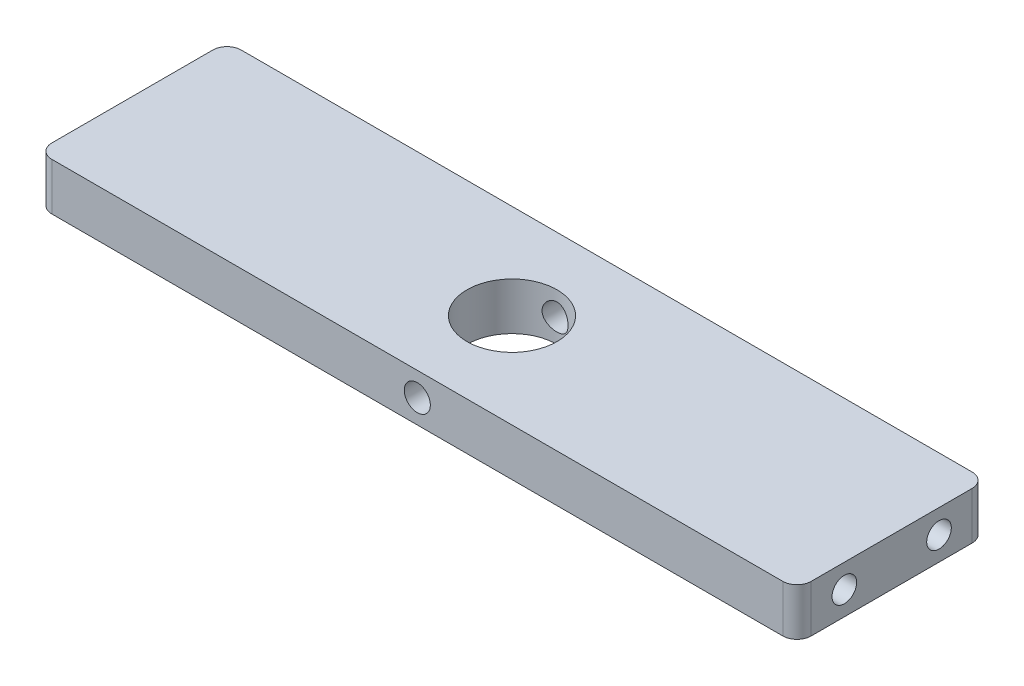
ISO-10303-21;
HEADER;
FILE_DESCRIPTION(('STEP AP214'),'2;1');
FILE_NAME('part.step','',(''),(''),'','','');
FILE_SCHEMA(('AUTOMOTIVE_DESIGN { 1 0 10303 214 1 1 1 1 }'));
ENDSEC;
DATA;
#1=APPLICATION_CONTEXT('core data for automotive mechanical design processes');
#2=APPLICATION_PROTOCOL_DEFINITION('international standard','automotive_design',2000,#1);
#3=PRODUCT_CONTEXT('',#1,'mechanical');
#4=PRODUCT('Part','Part','',(#3));
#5=PRODUCT_RELATED_PRODUCT_CATEGORY('part','',(#4));
#6=PRODUCT_DEFINITION_FORMATION('','',#4);
#7=PRODUCT_DEFINITION_CONTEXT('part definition',#1,'design');
#8=PRODUCT_DEFINITION('design','',#6,#7);
#9=PRODUCT_DEFINITION_SHAPE('','',#8);
#10=(LENGTH_UNIT() NAMED_UNIT(*) SI_UNIT(.MILLI.,.METRE.));
#11=(NAMED_UNIT(*) PLANE_ANGLE_UNIT() SI_UNIT($,.RADIAN.));
#12=(NAMED_UNIT(*) SI_UNIT($,.STERADIAN.) SOLID_ANGLE_UNIT());
#13=UNCERTAINTY_MEASURE_WITH_UNIT(LENGTH_MEASURE(1.E-05),#10,'distance_accuracy_value','');
#14=(GEOMETRIC_REPRESENTATION_CONTEXT(3) GLOBAL_UNCERTAINTY_ASSIGNED_CONTEXT((#13)) GLOBAL_UNIT_ASSIGNED_CONTEXT((#10,
#11,#12)) REPRESENTATION_CONTEXT('',''));
#15=CARTESIAN_POINT('',(0.,0.,0.));
#16=DIRECTION('',(0.,0.,1.));
#17=DIRECTION('',(1.,0.,0.));
#18=AXIS2_PLACEMENT_3D('',#15,#16,#17);
#19=CARTESIAN_POINT('',(0.,5.,0.));
#20=DIRECTION('',(0.,1.,0.));
#21=DIRECTION('',(0.,0.,1.));
#22=AXIS2_PLACEMENT_3D('',#19,#20,#21);
#23=PLANE('',#22);
#24=DIRECTION('',(1.,0.,0.));
#25=VECTOR('',#24,1.);
#26=CARTESIAN_POINT('',(80.2,5.,20.));
#27=LINE('',#26,#25);
#28=CARTESIAN_POINT('',(-77.2,5.,20.));
#29=VERTEX_POINT('',#28);
#30=CARTESIAN_POINT('',(77.2,5.,20.));
#31=VERTEX_POINT('',#30);
#32=EDGE_CURVE('E163',#29,#31,#27,.T.);
#33=ORIENTED_EDGE('',*,*,#32,.T.);
#34=CARTESIAN_POINT('',(77.2,5.,17.));
#35=DIRECTION('',(0.,1.,0.));
#36=DIRECTION('',(0.,0.,1.));
#37=AXIS2_PLACEMENT_3D('',#34,#35,#36);
#38=CIRCLE('',#37,3.);
#39=CARTESIAN_POINT('',(80.2,5.,17.));
#40=VERTEX_POINT('',#39);
#41=EDGE_CURVE('E203',#31,#40,#38,.T.);
#42=ORIENTED_EDGE('',*,*,#41,.T.);
#43=DIRECTION('',(0.,0.,-1.));
#44=VECTOR('',#43,1.);
#45=CARTESIAN_POINT('',(80.2,5.,20.));
#46=LINE('',#45,#44);
#47=CARTESIAN_POINT('',(80.2,5.,-17.));
#48=VERTEX_POINT('',#47);
#49=EDGE_CURVE('E167',#40,#48,#46,.T.);
#50=ORIENTED_EDGE('',*,*,#49,.T.);
#51=CARTESIAN_POINT('',(77.2,5.,-17.));
#52=DIRECTION('',(0.,1.,0.));
#53=DIRECTION('',(0.,0.,1.));
#54=AXIS2_PLACEMENT_3D('',#51,#52,#53);
#55=CIRCLE('',#54,3.);
#56=CARTESIAN_POINT('',(77.2,5.,-20.));
#57=VERTEX_POINT('',#56);
#58=EDGE_CURVE('E65',#48,#57,#55,.T.);
#59=ORIENTED_EDGE('',*,*,#58,.T.);
#60=DIRECTION('',(-1.,0.,0.));
#61=VECTOR('',#60,1.);
#62=CARTESIAN_POINT('',(80.2,5.,-20.));
#63=LINE('',#62,#61);
#64=CARTESIAN_POINT('',(-77.2,5.,-20.));
#65=VERTEX_POINT('',#64);
#66=EDGE_CURVE('E169',#57,#65,#63,.T.);
#67=ORIENTED_EDGE('',*,*,#66,.T.);
#68=CARTESIAN_POINT('',(-77.2,5.,-17.));
#69=DIRECTION('',(0.,1.,0.));
#70=DIRECTION('',(0.,0.,1.));
#71=AXIS2_PLACEMENT_3D('',#68,#69,#70);
#72=CIRCLE('',#71,3.);
#73=CARTESIAN_POINT('',(-80.2,5.,-17.));
#74=VERTEX_POINT('',#73);
#75=EDGE_CURVE('E198',#65,#74,#72,.T.);
#76=ORIENTED_EDGE('',*,*,#75,.T.);
#77=DIRECTION('',(0.,0.,1.));
#78=VECTOR('',#77,1.);
#79=CARTESIAN_POINT('',(-80.2,5.,20.));
#80=LINE('',#79,#78);
#81=CARTESIAN_POINT('',(-80.2,5.,17.));
#82=VERTEX_POINT('',#81);
#83=EDGE_CURVE('E160',#74,#82,#80,.T.);
#84=ORIENTED_EDGE('',*,*,#83,.T.);
#85=CARTESIAN_POINT('',(-77.2,5.,17.));
#86=DIRECTION('',(0.,1.,0.));
#87=DIRECTION('',(0.,0.,1.));
#88=AXIS2_PLACEMENT_3D('',#85,#86,#87);
#89=CIRCLE('',#88,3.);
#90=EDGE_CURVE('E200',#82,#29,#89,.T.);
#91=ORIENTED_EDGE('',*,*,#90,.T.);
#92=EDGE_LOOP('',(#33,#42,#50,#59,#67,#76,#84,#91));
#93=FACE_BOUND('',#92,.T.);
#94=CARTESIAN_POINT('',(0.,5.,0.));
#95=DIRECTION('',(0.,1.,0.));
#96=DIRECTION('',(0.,0.,1.));
#97=AXIS2_PLACEMENT_3D('',#94,#95,#96);
#98=CIRCLE('',#97,9.5);
#99=CARTESIAN_POINT('',(0.,5.,9.50000000000001));
#100=VERTEX_POINT('',#99);
#101=EDGE_CURVE('E154',#100,#100,#98,.T.);
#102=ORIENTED_EDGE('',*,*,#101,.F.);
#103=EDGE_LOOP('',(#102));
#104=FACE_BOUND('',#103,.T.);
#105=ADVANCED_FACE('F36',(#93,#104),#23,.T.);
#106=CARTESIAN_POINT('',(0.,-5.,0.));
#107=DIRECTION('',(0.,1.,0.));
#108=DIRECTION('',(0.,0.,1.));
#109=AXIS2_PLACEMENT_3D('',#106,#107,#108);
#110=PLANE('',#109);
#111=DIRECTION('',(0.,0.,-1.));
#112=VECTOR('',#111,1.);
#113=CARTESIAN_POINT('',(80.2,-5.,20.));
#114=LINE('',#113,#112);
#115=CARTESIAN_POINT('',(80.2,-5.,17.));
#116=VERTEX_POINT('',#115);
#117=CARTESIAN_POINT('',(80.2,-5.,-17.));
#118=VERTEX_POINT('',#117);
#119=EDGE_CURVE('E177',#116,#118,#114,.T.);
#120=ORIENTED_EDGE('',*,*,#119,.F.);
#121=CARTESIAN_POINT('',(77.2,-5.,17.));
#122=DIRECTION('',(0.,1.,0.));
#123=DIRECTION('',(0.,0.,1.));
#124=AXIS2_PLACEMENT_3D('',#121,#122,#123);
#125=CIRCLE('',#124,3.);
#126=CARTESIAN_POINT('',(77.2,-5.,20.));
#127=VERTEX_POINT('',#126);
#128=EDGE_CURVE('E191',#116,#127,#125,.F.);
#129=ORIENTED_EDGE('',*,*,#128,.T.);
#130=DIRECTION('',(1.,0.,0.));
#131=VECTOR('',#130,1.);
#132=CARTESIAN_POINT('',(80.2,-5.,20.));
#133=LINE('',#132,#131);
#134=CARTESIAN_POINT('',(-77.2,-5.,20.));
#135=VERTEX_POINT('',#134);
#136=EDGE_CURVE('E174',#135,#127,#133,.T.);
#137=ORIENTED_EDGE('',*,*,#136,.F.);
#138=CARTESIAN_POINT('',(-77.2,-5.,17.));
#139=DIRECTION('',(0.,1.,0.));
#140=DIRECTION('',(0.,0.,1.));
#141=AXIS2_PLACEMENT_3D('',#138,#139,#140);
#142=CIRCLE('',#141,3.);
#143=CARTESIAN_POINT('',(-80.2,-5.,17.));
#144=VERTEX_POINT('',#143);
#145=EDGE_CURVE('E187',#135,#144,#142,.F.);
#146=ORIENTED_EDGE('',*,*,#145,.T.);
#147=DIRECTION('',(0.,0.,1.));
#148=VECTOR('',#147,1.);
#149=CARTESIAN_POINT('',(-80.2,-5.,20.));
#150=LINE('',#149,#148);
#151=CARTESIAN_POINT('',(-80.2,-5.,-17.));
#152=VERTEX_POINT('',#151);
#153=EDGE_CURVE('E157',#152,#144,#150,.T.);
#154=ORIENTED_EDGE('',*,*,#153,.F.);
#155=CARTESIAN_POINT('',(-77.2,-5.,-17.));
#156=DIRECTION('',(0.,1.,0.));
#157=DIRECTION('',(0.,0.,1.));
#158=AXIS2_PLACEMENT_3D('',#155,#156,#157);
#159=CIRCLE('',#158,3.);
#160=CARTESIAN_POINT('',(-77.2,-5.,-20.));
#161=VERTEX_POINT('',#160);
#162=EDGE_CURVE('E185',#152,#161,#159,.F.);
#163=ORIENTED_EDGE('',*,*,#162,.T.);
#164=DIRECTION('',(-1.,0.,0.));
#165=VECTOR('',#164,1.);
#166=CARTESIAN_POINT('',(80.2,-5.,-20.));
#167=LINE('',#166,#165);
#168=CARTESIAN_POINT('',(77.2,-5.,-20.));
#169=VERTEX_POINT('',#168);
#170=EDGE_CURVE('E164',#169,#161,#167,.T.);
#171=ORIENTED_EDGE('',*,*,#170,.F.);
#172=CARTESIAN_POINT('',(77.2,-5.,-17.));
#173=DIRECTION('',(0.,1.,0.));
#174=DIRECTION('',(0.,0.,1.));
#175=AXIS2_PLACEMENT_3D('',#172,#173,#174);
#176=CIRCLE('',#175,3.);
#177=EDGE_CURVE('E189',#169,#118,#176,.F.);
#178=ORIENTED_EDGE('',*,*,#177,.T.);
#179=EDGE_LOOP('',(#120,#129,#137,#146,#154,#163,#171,#178));
#180=FACE_BOUND('',#179,.T.);
#181=CARTESIAN_POINT('',(0.,-5.,0.));
#182=DIRECTION('',(0.,1.,0.));
#183=DIRECTION('',(0.,0.,1.));
#184=AXIS2_PLACEMENT_3D('',#181,#182,#183);
#185=CIRCLE('',#184,9.5);
#186=CARTESIAN_POINT('',(0.,-5.,9.50000000000001));
#187=VERTEX_POINT('',#186);
#188=EDGE_CURVE('E153',#187,#187,#185,.T.);
#189=ORIENTED_EDGE('',*,*,#188,.T.);
#190=EDGE_LOOP('',(#189));
#191=FACE_BOUND('',#190,.T.);
#192=ADVANCED_FACE('F258',(#180,#191),#110,.F.);
#193=CARTESIAN_POINT('',(-80.2,5.,20.));
#194=DIRECTION('',(1.,0.,0.));
#195=DIRECTION('',(0.,0.,-1.));
#196=AXIS2_PLACEMENT_3D('',#193,#194,#195);
#197=PLANE('',#196);
#198=CARTESIAN_POINT('',(-80.2,0.,-9.99999999999999));
#199=DIRECTION('',(-1.,0.,0.));
#200=DIRECTION('',(0.,0.,1.));
#201=AXIS2_PLACEMENT_3D('',#198,#199,#200);
#202=CIRCLE('',#201,2.59999999999999);
#203=CARTESIAN_POINT('',(-80.2,0.,-7.4));
#204=VERTEX_POINT('',#203);
#205=EDGE_CURVE('E141',#204,#204,#202,.T.);
#206=ORIENTED_EDGE('',*,*,#205,.F.);
#207=EDGE_LOOP('',(#206));
#208=FACE_BOUND('',#207,.T.);
#209=CARTESIAN_POINT('',(-80.2,0.,10.));
#210=DIRECTION('',(-1.,0.,0.));
#211=DIRECTION('',(0.,0.,1.));
#212=AXIS2_PLACEMENT_3D('',#209,#210,#211);
#213=CIRCLE('',#212,2.59999999999999);
#214=CARTESIAN_POINT('',(-80.2,0.,12.6));
#215=VERTEX_POINT('',#214);
#216=EDGE_CURVE('E147',#215,#215,#213,.T.);
#217=ORIENTED_EDGE('',*,*,#216,.F.);
#218=EDGE_LOOP('',(#217));
#219=FACE_BOUND('',#218,.T.);
#220=ORIENTED_EDGE('',*,*,#153,.T.);
#221=DIRECTION('',(0.,-1.,0.));
#222=VECTOR('',#221,1.);
#223=CARTESIAN_POINT('',(-80.2,5.,17.));
#224=LINE('',#223,#222);
#225=EDGE_CURVE('E11',#144,#82,#224,.F.);
#226=ORIENTED_EDGE('',*,*,#225,.T.);
#227=ORIENTED_EDGE('',*,*,#83,.F.);
#228=DIRECTION('',(0.,-1.,0.));
#229=VECTOR('',#228,1.);
#230=CARTESIAN_POINT('',(-80.2,5.,-17.));
#231=LINE('',#230,#229);
#232=EDGE_CURVE('E50',#74,#152,#231,.T.);
#233=ORIENTED_EDGE('',*,*,#232,.T.);
#234=EDGE_LOOP('',(#220,#226,#227,#233));
#235=FACE_BOUND('',#234,.T.);
#236=ADVANCED_FACE('F262',(#208,#219,#235),#197,.F.);
#237=CARTESIAN_POINT('',(80.2,5.,20.));
#238=DIRECTION('',(0.,0.,-1.));
#239=DIRECTION('',(-1.,0.,0.));
#240=AXIS2_PLACEMENT_3D('',#237,#238,#239);
#241=PLANE('',#240);
#242=CARTESIAN_POINT('',(0.,0.,20.));
#243=DIRECTION('',(0.,0.,-1.));
#244=DIRECTION('',(-1.,0.,0.));
#245=AXIS2_PLACEMENT_3D('',#242,#243,#244);
#246=CIRCLE('',#245,2.74999999999999);
#247=CARTESIAN_POINT('',(-2.74999999999999,0.,20.));
#248=VERTEX_POINT('',#247);
#249=EDGE_CURVE('E215',#248,#248,#246,.T.);
#250=ORIENTED_EDGE('',*,*,#249,.T.);
#251=EDGE_LOOP('',(#250));
#252=FACE_BOUND('',#251,.T.);
#253=ORIENTED_EDGE('',*,*,#136,.T.);
#254=DIRECTION('',(0.,-1.,0.));
#255=VECTOR('',#254,1.);
#256=CARTESIAN_POINT('',(77.2,5.,20.));
#257=LINE('',#256,#255);
#258=EDGE_CURVE('E196',#127,#31,#257,.F.);
#259=ORIENTED_EDGE('',*,*,#258,.T.);
#260=ORIENTED_EDGE('',*,*,#32,.F.);
#261=DIRECTION('',(0.,-1.,0.));
#262=VECTOR('',#261,1.);
#263=CARTESIAN_POINT('',(-77.2,5.,20.));
#264=LINE('',#263,#262);
#265=EDGE_CURVE('E193',#29,#135,#264,.T.);
#266=ORIENTED_EDGE('',*,*,#265,.T.);
#267=EDGE_LOOP('',(#253,#259,#260,#266));
#268=FACE_BOUND('',#267,.T.);
#269=ADVANCED_FACE('F273',(#252,#268),#241,.F.);
#270=CARTESIAN_POINT('',(80.2,5.,20.));
#271=DIRECTION('',(-1.,0.,0.));
#272=DIRECTION('',(0.,0.,1.));
#273=AXIS2_PLACEMENT_3D('',#270,#271,#272);
#274=PLANE('',#273);
#275=CARTESIAN_POINT('',(80.2,0.,-9.99999999999999));
#276=DIRECTION('',(1.,0.,0.));
#277=DIRECTION('',(0.,0.,-1.));
#278=AXIS2_PLACEMENT_3D('',#275,#276,#277);
#279=CIRCLE('',#278,2.59999999999999);
#280=CARTESIAN_POINT('',(80.2,0.,-12.6));
#281=VERTEX_POINT('',#280);
#282=EDGE_CURVE('E130',#281,#281,#279,.T.);
#283=ORIENTED_EDGE('',*,*,#282,.F.);
#284=EDGE_LOOP('',(#283));
#285=FACE_BOUND('',#284,.T.);
#286=CARTESIAN_POINT('',(80.2,0.,10.));
#287=DIRECTION('',(1.,0.,0.));
#288=DIRECTION('',(0.,0.,-1.));
#289=AXIS2_PLACEMENT_3D('',#286,#287,#288);
#290=CIRCLE('',#289,2.59999999999999);
#291=CARTESIAN_POINT('',(80.2,0.,7.40000000000002));
#292=VERTEX_POINT('',#291);
#293=EDGE_CURVE('E129',#292,#292,#290,.T.);
#294=ORIENTED_EDGE('',*,*,#293,.F.);
#295=EDGE_LOOP('',(#294));
#296=FACE_BOUND('',#295,.T.);
#297=ORIENTED_EDGE('',*,*,#49,.F.);
#298=DIRECTION('',(0.,-1.,0.));
#299=VECTOR('',#298,1.);
#300=CARTESIAN_POINT('',(80.2,5.,17.));
#301=LINE('',#300,#299);
#302=EDGE_CURVE('E182',#40,#116,#301,.T.);
#303=ORIENTED_EDGE('',*,*,#302,.T.);
#304=ORIENTED_EDGE('',*,*,#119,.T.);
#305=DIRECTION('',(0.,-1.,0.));
#306=VECTOR('',#305,1.);
#307=CARTESIAN_POINT('',(80.2,5.,-17.));
#308=LINE('',#307,#306);
#309=EDGE_CURVE('E171',#118,#48,#308,.F.);
#310=ORIENTED_EDGE('',*,*,#309,.T.);
#311=EDGE_LOOP('',(#297,#303,#304,#310));
#312=FACE_BOUND('',#311,.T.);
#313=ADVANCED_FACE('F269',(#285,#296,#312),#274,.F.);
#314=CARTESIAN_POINT('',(80.2,5.,-20.));
#315=DIRECTION('',(0.,0.,1.));
#316=DIRECTION('',(1.,0.,0.));
#317=AXIS2_PLACEMENT_3D('',#314,#315,#316);
#318=PLANE('',#317);
#319=CARTESIAN_POINT('',(0.,0.,-20.));
#320=DIRECTION('',(0.,0.,-1.));
#321=DIRECTION('',(-1.,0.,0.));
#322=AXIS2_PLACEMENT_3D('',#319,#320,#321);
#323=CIRCLE('',#322,2.74999999999999);
#324=CARTESIAN_POINT('',(-2.74999999999999,0.,-20.));
#325=VERTEX_POINT('',#324);
#326=EDGE_CURVE('E486',#325,#325,#323,.T.);
#327=ORIENTED_EDGE('',*,*,#326,.F.);
#328=EDGE_LOOP('',(#327));
#329=FACE_BOUND('',#328,.T.);
#330=ORIENTED_EDGE('',*,*,#66,.F.);
#331=DIRECTION('',(0.,-1.,0.));
#332=VECTOR('',#331,1.);
#333=CARTESIAN_POINT('',(77.2,5.,-20.));
#334=LINE('',#333,#332);
#335=EDGE_CURVE('E206',#57,#169,#334,.T.);
#336=ORIENTED_EDGE('',*,*,#335,.T.);
#337=ORIENTED_EDGE('',*,*,#170,.T.);
#338=DIRECTION('',(0.,-1.,0.));
#339=VECTOR('',#338,1.);
#340=CARTESIAN_POINT('',(-77.2,5.,-20.));
#341=LINE('',#340,#339);
#342=EDGE_CURVE('E58',#161,#65,#341,.F.);
#343=ORIENTED_EDGE('',*,*,#342,.T.);
#344=EDGE_LOOP('',(#330,#336,#337,#343));
#345=FACE_BOUND('',#344,.T.);
#346=ADVANCED_FACE('F254',(#329,#345),#318,.F.);
#347=CARTESIAN_POINT('',(0.,5.,0.));
#348=DIRECTION('',(0.,-1.,0.));
#349=DIRECTION('',(0.,0.,-1.));
#350=AXIS2_PLACEMENT_3D('',#347,#348,#349);
#351=CYLINDRICAL_SURFACE('',#350,9.5);
#352=CARTESIAN_POINT('',(0.,2.74999999999999,-9.49999999999999));
#353=CARTESIAN_POINT('',(-0.151103684405157,2.74999754124777,-9.49999832244704));
#354=CARTESIAN_POINT('',(-0.302232490543062,2.73750454335048,-9.49636009363154));
#355=CARTESIAN_POINT('',(-0.600104468590077,2.68797129048408,-9.48220118050607));
#356=CARTESIAN_POINT('',(-0.746846052747299,2.65092225834138,-9.47167803530685));
#357=CARTESIAN_POINT('',(-1.03160321111771,2.55360637078811,-9.44490511841536));
#358=CARTESIAN_POINT('',(-1.16963081556959,2.49337237751823,-9.42866345486217));
#359=CARTESIAN_POINT('',(-1.43362680551053,2.35152697754196,-9.39215081459136));
#360=CARTESIAN_POINT('',(-1.55959383673314,2.26991317395903,-9.37187938616094));
#361=CARTESIAN_POINT('',(-1.79928390939949,2.08530821731493,-9.32886791379249));
#362=CARTESIAN_POINT('',(-1.91263626798143,1.98184695218117,-9.30607995192475));
#363=CARTESIAN_POINT('',(-2.12064810193771,1.75748683780256,-9.26089657094851));
#364=CARTESIAN_POINT('',(-2.21530468820945,1.63658529845747,-9.23850121299656));
#365=CARTESIAN_POINT('',(-2.3851412003241,1.37769858838737,-9.1961374284627));
#366=CARTESIAN_POINT('',(-2.45987724499969,1.23941151163317,-9.17622885775419));
#367=CARTESIAN_POINT('',(-2.58488523493734,0.951563505842819,-9.14180519471755));
#368=CARTESIAN_POINT('',(-2.63516260005811,0.802005082942984,-9.12728890766878));
#369=CARTESIAN_POINT('',(-2.70850546492159,0.500004433916435,-9.1057912455198));
#370=CARTESIAN_POINT('',(-2.73225075845376,0.347741018028173,-9.09862204672375));
#371=CARTESIAN_POINT('',(-2.75397717672036,0.0412359070571991,-9.09207071188814));
#372=CARTESIAN_POINT('',(-2.75196406431899,-0.113005337816634,-9.09268683405768));
#373=CARTESIAN_POINT('',(-2.72276662670943,-0.413634335356509,-9.10146952020892));
#374=CARTESIAN_POINT('',(-2.69642417137727,-0.560112434957022,-9.10938354042197));
#375=CARTESIAN_POINT('',(-2.62067211905443,-0.846474583113476,-9.13146312538767));
#376=CARTESIAN_POINT('',(-2.5712603872788,-0.986358020093244,-9.1456292686927));
#377=CARTESIAN_POINT('',(-2.45013108041959,-1.25766325857889,-9.17882509752256));
#378=CARTESIAN_POINT('',(-2.37813330895177,-1.38895224019629,-9.19791530942063));
#379=CARTESIAN_POINT('',(-2.21407061426737,-1.63787169462001,-9.23877807968907));
#380=CARTESIAN_POINT('',(-2.12200112000823,-1.75549904682108,-9.26055124857193));
#381=CARTESIAN_POINT('',(-1.91618685498142,-1.97854309496557,-9.3053597726663));
#382=CARTESIAN_POINT('',(-1.80174061950394,-2.08331030255787,-9.32841134979004));
#383=CARTESIAN_POINT('',(-1.55661714618185,-2.27231056222138,-9.37242908900899));
#384=CARTESIAN_POINT('',(-1.42593902284807,-2.35654249329973,-9.39339513722105));
#385=CARTESIAN_POINT('',(-1.15093833312673,-2.50243927488955,-9.43104916921502));
#386=CARTESIAN_POINT('',(-1.00654019019467,-2.56396878066789,-9.44771132340433));
#387=CARTESIAN_POINT('',(-0.708852909931501,-2.66168204194398,-9.47469408752444));
#388=CARTESIAN_POINT('',(-0.555566086357655,-2.69787236154338,-9.48501633971808));
#389=CARTESIAN_POINT('',(-0.24998107430183,-2.74281889776172,-9.49790021134739));
#390=CARTESIAN_POINT('',(-0.0978227914435337,-2.7524562282378,-9.50071098704387));
#391=CARTESIAN_POINT('',(0.205942559875623,-2.74648095244812,-9.49898138198389));
#392=CARTESIAN_POINT('',(0.357549694070784,-2.73087146342334,-9.49444190876729));
#393=CARTESIAN_POINT('',(0.652642778569646,-2.67556180638033,-9.47868434388846));
#394=CARTESIAN_POINT('',(0.79623201103296,-2.63636883617609,-9.46760695334968));
#395=CARTESIAN_POINT('',(1.0747718814908,-2.53560800406058,-9.44004611204557));
#396=CARTESIAN_POINT('',(1.20972150725607,-2.47403752598894,-9.4235620292044));
#397=CARTESIAN_POINT('',(1.47045331248785,-2.3287401729985,-9.38645317249359));
#398=CARTESIAN_POINT('',(1.59596781480529,-2.24455478541085,-9.3657451285769));
#399=CARTESIAN_POINT('',(1.83139177054953,-2.05698055414271,-9.32257224582276));
#400=CARTESIAN_POINT('',(1.94129756906272,-1.95358722579483,-9.30010699742408));
#401=CARTESIAN_POINT('',(2.14621104649742,-1.72639898636424,-9.25500783915002));
#402=CARTESIAN_POINT('',(2.24059318661215,-1.60203477635804,-9.23239367776249));
#403=CARTESIAN_POINT('',(2.40718239059993,-1.33874440341558,-9.19036893236843));
#404=CARTESIAN_POINT('',(2.47939018279238,-1.19981871895394,-9.17095824315311));
#405=CARTESIAN_POINT('',(2.59906135276598,-0.911894033414351,-9.13776453706623));
#406=CARTESIAN_POINT('',(2.64665229406023,-0.762951576021275,-9.12395259006894));
#407=CARTESIAN_POINT('',(2.71595633948742,-0.458698395809335,-9.10356585395777));
#408=CARTESIAN_POINT('',(2.73767754597491,-0.303389682662652,-9.09698879893802));
#409=CARTESIAN_POINT('',(2.75410126157505,0.00272100951974566,-9.09202893674775));
#410=CARTESIAN_POINT('',(2.74981852412951,0.153464301427592,-9.09333835862443));
#411=CARTESIAN_POINT('',(2.71675579324348,0.451982007282177,-9.10327026037627));
#412=CARTESIAN_POINT('',(2.68797665822231,0.599756525076961,-9.11189248399127));
#413=CARTESIAN_POINT('',(2.60737233149368,0.886608661207581,-9.13527934560715));
#414=CARTESIAN_POINT('',(2.55579824435838,1.02576270187393,-9.14997694724351));
#415=CARTESIAN_POINT('',(2.43126245291441,1.29355306042231,-9.18385041129181));
#416=CARTESIAN_POINT('',(2.35829688090382,1.42218747091165,-9.20302708341754));
#417=CARTESIAN_POINT('',(2.19012593088044,1.6700407247756,-9.24451630224842));
#418=CARTESIAN_POINT('',(2.09424562749777,1.78878745087847,-9.26691363088848));
#419=CARTESIAN_POINT('',(1.8842041101317,2.00883518550836,-9.31188982023243));
#420=CARTESIAN_POINT('',(1.77003826301001,2.11013175902883,-9.33446872556291));
#421=CARTESIAN_POINT('',(1.52301108308858,2.29507449070068,-9.37798262689348));
#422=CARTESIAN_POINT('',(1.38973368573321,2.37818030668016,-9.3988580217393));
#423=CARTESIAN_POINT('',(1.11049416144359,2.52068290210943,-9.43591993772834));
#424=CARTESIAN_POINT('',(0.964538760766332,2.58009216122512,-9.45210892570754));
#425=CARTESIAN_POINT('',(0.683003090577108,2.66738259861147,-9.47633414525844));
#426=CARTESIAN_POINT('',(0.548418661837644,2.69828426160835,-9.48513842472121));
#427=CARTESIAN_POINT('',(0.275896149880606,2.73959263042157,-9.49697170809104));
#428=CARTESIAN_POINT('',(0.137958545422938,2.75000224485511,-9.50000153161563));
#429=CARTESIAN_POINT('',(0.,2.74999999999999,-9.49999999999999));
#430=B_SPLINE_CURVE_WITH_KNOTS('',3,(#352,#353,#354,#355,#356,#357,#358,#359,#360,#361,#362,
#363,#364,#365,#366,#367,#368,#369,#370,#371,#372,#373,#374,#375,#376,#377,#378,#379,#380,#381,
#382,#383,#384,#385,#386,#387,#388,#389,#390,#391,#392,#393,#394,#395,#396,#397,#398,#399,#400,
#401,#402,#403,#404,#405,#406,#407,#408,#409,#410,#411,#412,#413,#414,#415,#416,#417,#418,#419,
#420,#421,#422,#423,#424,#425,#426,#427,#428,#429),.UNSPECIFIED.,.T.,.F.,(4,2,2,2,2,2,2,2,2,2,2,
2,2,2,2,2,2,2,2,2,2,2,2,2,2,2,2,2,2,2,2,2,2,2,2,2,2,2,4),(0.,0.452804573289333,
0.905771081895441,1.35809791035427,1.81047547059562,2.27381553554251,2.73722714561843,
3.21023444408136,3.68313687990035,4.14362319086672,4.60400648017588,5.04903287760034,
5.4941004650469,5.94492368071086,6.39584967224767,6.86424271505823,7.3326613210863,
7.80382901933557,8.27487461665875,8.73008958851485,9.18524835897749,9.63095163111832,
10.0767070273173,10.5322890334959,10.9879775428881,11.4589952340736,11.9299974529658,
12.3985338697172,12.8669235030808,13.3171557415862,13.7673722033992,14.2127481976107,
14.6582047680457,15.1188873659056,15.5796868753881,16.0527270031476,16.5255176768594,
16.9389895859487,17.3524028030901),.UNSPECIFIED.);
#431=CARTESIAN_POINT('',(0.,2.74999999999999,-9.49999999999999));
#432=VERTEX_POINT('',#431);
#433=EDGE_CURVE('E40',#432,#432,#430,.T.);
#434=ORIENTED_EDGE('',*,*,#433,.F.);
#435=EDGE_LOOP('',(#434));
#436=FACE_BOUND('',#435,.T.);
#437=CARTESIAN_POINT('',(-2.74999999999999,0.,9.09326673973662));
#438=CARTESIAN_POINT('',(-2.74999748739826,0.150953997952812,9.0932687234266));
#439=CARTESIAN_POINT('',(-2.73752836043792,0.30193320221528,9.09706676491743));
#440=CARTESIAN_POINT('',(-2.68809850739297,0.599495166690835,9.11179297629922));
#441=CARTESIAN_POINT('',(-2.65112828541667,0.7460761992712,9.12272391066089));
#442=CARTESIAN_POINT('',(-2.55404261737731,1.03049237957935,9.15037642687374));
#443=CARTESIAN_POINT('',(-2.49396369429824,1.16834093046682,9.16708886696219));
#444=CARTESIAN_POINT('',(-2.35248438083627,1.43203232307547,9.2044091953515));
#445=CARTESIAN_POINT('',(-2.2710812851814,1.55787363874416,9.22501757781518));
#446=CARTESIAN_POINT('',(-2.08669738026416,1.79768605462858,9.26848858321332));
#447=CARTESIAN_POINT('',(-1.98319895966932,1.91125102911558,9.29139667056131));
#448=CARTESIAN_POINT('',(-1.7586729151014,2.1196787486956,9.33649625564446));
#449=CARTESIAN_POINT('',(-1.63764319087852,2.21453924977346,9.35868766713176));
#450=CARTESIAN_POINT('',(-1.37862488560984,2.38460579860939,9.40036700016277));
#451=CARTESIAN_POINT('',(-1.24035617051953,2.45940113657735,9.4197950820437));
#452=CARTESIAN_POINT('',(-0.952546748651445,2.58452360437367,9.45323267734275));
#453=CARTESIAN_POINT('',(-0.803008304254653,2.63485563014175,9.46724327486865));
#454=CARTESIAN_POINT('',(-0.501150094253812,2.70828844620235,9.48794567226656));
#455=CARTESIAN_POINT('',(-0.34901175123507,2.73208169761808,9.49482323556994));
#456=CARTESIAN_POINT('',(-0.0427575868891259,2.75394753941673,9.50113730326528));
#457=CARTESIAN_POINT('',(0.111357840865043,2.75202517193673,9.50057526636177));
#458=CARTESIAN_POINT('',(0.412346021008186,2.7229866470039,9.49220634853773));
#459=CARTESIAN_POINT('',(0.55929798756627,2.69661977235507,9.48461494301188));
#460=CARTESIAN_POINT('',(0.846594418858577,2.62066022236096,9.46329962681945));
#461=CARTESIAN_POINT('',(0.986938476435692,2.57106611788768,9.44957533881047));
#462=CARTESIAN_POINT('',(1.25885921003556,2.44953101496587,9.41723137172921));
#463=CARTESIAN_POINT('',(1.39032097883386,2.37734754476926,9.39855892989722));
#464=CARTESIAN_POINT('',(1.63951063706876,2.21287253537106,9.35830968916391));
#465=CARTESIAN_POINT('',(1.75723544220935,2.12057649367597,9.33673224034829));
#466=CARTESIAN_POINT('',(1.98008241293625,1.91457948117918,9.29207535798244));
#467=CARTESIAN_POINT('',(2.0845985063612,1.80022768460242,9.26896981688192));
#468=CARTESIAN_POINT('',(2.27313434452746,1.55538915891514,9.22454700408495));
#469=CARTESIAN_POINT('',(2.35715233347622,1.42490104906865,9.20322988568079));
#470=CARTESIAN_POINT('',(2.50288155232304,1.14999160301189,9.16467885377943));
#471=CARTESIAN_POINT('',(2.56439983263043,1.00546261095701,9.14748067677288));
#472=CARTESIAN_POINT('',(2.6620528166619,0.707485933075982,9.1195440587038));
#473=CARTESIAN_POINT('',(2.69819513514645,0.554040937721674,9.10880367993903));
#474=CARTESIAN_POINT('',(2.74296654089158,0.248323982195786,9.09542000648067));
#475=CARTESIAN_POINT('',(2.75251131884848,0.0961977901220346,9.09250735225997));
#476=CARTESIAN_POINT('',(2.74636270896667,-0.207483134137307,9.09436660743294));
#477=CARTESIAN_POINT('',(2.73067256722487,-0.35903793731,9.0991375284491));
#478=CARTESIAN_POINT('',(2.67531246643312,-0.653551901521397,9.11556333018618));
#479=CARTESIAN_POINT('',(2.63621916462593,-0.796629625139111,9.12705251858283));
#480=CARTESIAN_POINT('',(2.53582439387691,-1.07418982938121,9.15545183534517));
#481=CARTESIAN_POINT('',(2.47451966099629,-1.20867104334192,9.17236276038544));
#482=CARTESIAN_POINT('',(2.32966586195411,-1.46898005406383,9.21023237443963));
#483=CARTESIAN_POINT('',(2.2455933821662,-1.59450294220978,9.23128262611337));
#484=CARTESIAN_POINT('',(2.05822094195759,-1.82999443224549,9.2748564163255));
#485=CARTESIAN_POINT('',(1.95491670148968,-1.93995956213451,9.29738028209305));
#486=CARTESIAN_POINT('',(1.72773062477627,-2.14515188711669,9.34231184375261));
#487=CARTESIAN_POINT('',(1.60325793777754,-2.23973327074385,9.36468823773964));
#488=CARTESIAN_POINT('',(1.33968263632317,-2.40667402715686,9.40600969237693));
#489=CARTESIAN_POINT('',(1.20058077950734,-2.47903454999358,9.42495493058741));
#490=CARTESIAN_POINT('',(0.912649637267854,-2.59878572717537,9.45715985552087));
#491=CARTESIAN_POINT('',(0.76390386673592,-2.64636509519229,9.4704623641226));
#492=CARTESIAN_POINT('',(0.460077462260284,-2.71571190108874,9.49007216753953));
#493=CARTESIAN_POINT('',(0.304998516156486,-2.73748617038252,9.49638131368721));
#494=CARTESIAN_POINT('',(-0.00110360027676766,-2.75411458511434,9.50118901213468));
#495=CARTESIAN_POINT('',(-0.152072094059064,-2.74990857251865,9.49996026070431));
#496=CARTESIAN_POINT('',(-0.451061285439779,-2.71692141631086,9.49046443510555));
#497=CARTESIAN_POINT('',(-0.599082130390087,-2.6881415043108,9.48219771367118));
#498=CARTESIAN_POINT('',(-0.886632373889604,-2.60739003105712,9.45962516167449));
#499=CARTESIAN_POINT('',(-1.02622846086624,-2.55563879797741,9.44537677272285));
#500=CARTESIAN_POINT('',(-1.29483253812965,-2.43060987631273,9.4123186286117));
#501=CARTESIAN_POINT('',(-1.4238388572462,-2.35732879842856,9.39350815535523));
#502=CARTESIAN_POINT('',(-1.67185152283712,-2.18873776139429,9.35260387019407));
#503=CARTESIAN_POINT('',(-1.79043576764824,-2.09282695151212,9.33042776311656));
#504=CARTESIAN_POINT('',(-2.01014226552737,-1.88279961772196,9.28557628255654));
#505=CARTESIAN_POINT('',(-2.11125962575054,-1.76867800975005,9.2629007711794));
#506=CARTESIAN_POINT('',(-2.29590967855622,-1.5217437851798,9.21889747182868));
#507=CARTESIAN_POINT('',(-2.3788899323709,-1.38850756993255,9.1976230427331));
#508=CARTESIAN_POINT('',(-2.52116782261767,-1.1093783411363,9.15964892123512));
#509=CARTESIAN_POINT('',(-2.58047823798445,-0.963492208987271,9.14294676187752));
#510=CARTESIAN_POINT('',(-2.66758164153756,-0.682186210947399,9.1178830574584));
#511=CARTESIAN_POINT('',(-2.69840768332365,-0.547769200753621,9.10873489340992));
#512=CARTESIAN_POINT('',(-2.7396162907341,-0.275574749122089,9.09642633252115));
#513=CARTESIAN_POINT('',(-2.75000229362049,-0.137797876635266,9.09326492893153));
#514=CARTESIAN_POINT('',(-2.74999999999999,0.,9.09326673973662));
#515=B_SPLINE_CURVE_WITH_KNOTS('',3,(#437,#438,#439,#440,#441,#442,#443,#444,#445,#446,#447,
#448,#449,#450,#451,#452,#453,#454,#455,#456,#457,#458,#459,#460,#461,#462,#463,#464,#465,#466,
#467,#468,#469,#470,#471,#472,#473,#474,#475,#476,#477,#478,#479,#480,#481,#482,#483,#484,#485,
#486,#487,#488,#489,#490,#491,#492,#493,#494,#495,#496,#497,#498,#499,#500,#501,#502,#503,#504,
#505,#506,#507,#508,#509,#510,#511,#512,#513,#514),.UNSPECIFIED.,.T.,.F.,(4,2,2,2,2,2,2,2,2,2,2,
2,2,2,2,2,2,2,2,2,2,2,2,2,2,2,2,2,2,2,2,2,2,2,2,2,2,2,4),(0.,0.452354225330143,
0.904883872238968,1.35670122175645,1.80857591845844,2.27250302645481,2.73648575894589,
3.20934458559213,3.68210873811819,4.14222565416551,4.60225235505727,5.04862841363625,
5.49503194050778,5.94640171918052,6.39787264758003,6.86559236955406,7.33335214063168,
7.80503408252509,8.2765744226185,8.73166742703895,9.1867018951981,9.63096083350223,
10.0752850815324,10.5308477745653,10.9865119749869,11.4580283883479,11.9295203940453,
12.3973673644645,12.8650904535168,13.3159951225511,13.766877194153,14.2135250840874,
14.6602433245154,15.1205137475931,15.5809128938304,16.0538214362182,16.52647431698,
16.9394738892603,17.352404004281),.UNSPECIFIED.);
#516=CARTESIAN_POINT('',(-2.74999999999999,0.,9.09326673973662));
#517=VERTEX_POINT('',#516);
#518=EDGE_CURVE('E210',#517,#517,#515,.T.);
#519=ORIENTED_EDGE('',*,*,#518,.F.);
#520=EDGE_LOOP('',(#519));
#521=FACE_BOUND('',#520,.T.);
#522=ORIENTED_EDGE('',*,*,#101,.T.);
#523=EDGE_LOOP('',(#522));
#524=FACE_BOUND('',#523,.T.);
#525=ORIENTED_EDGE('',*,*,#188,.F.);
#526=EDGE_LOOP('',(#525));
#527=FACE_BOUND('',#526,.T.);
#528=ADVANCED_FACE('F216',(#436,#521,#524,#527),#351,.F.);
#529=CARTESIAN_POINT('',(-50.2,0.,10.));
#530=DIRECTION('',(-1.,0.,0.));
#531=DIRECTION('',(0.,0.,1.));
#532=AXIS2_PLACEMENT_3D('',#529,#530,#531);
#533=CONICAL_SURFACE('',#532,2.6,1.02974425867665);
#534=CARTESIAN_POINT('',(-48.6377623905283,0.,10.));
#535=VERTEX_POINT('',#534);
#536=VERTEX_LOOP('',#535);
#537=FACE_BOUND('',#536,.T.);
#538=CARTESIAN_POINT('',(-50.2,0.,10.));
#539=DIRECTION('',(-1.,0.,0.));
#540=DIRECTION('',(0.,0.,1.));
#541=AXIS2_PLACEMENT_3D('',#538,#539,#540);
#542=CIRCLE('',#541,2.6);
#543=CARTESIAN_POINT('',(-50.2,0.,12.6));
#544=VERTEX_POINT('',#543);
#545=EDGE_CURVE('E150',#544,#544,#542,.T.);
#546=ORIENTED_EDGE('',*,*,#545,.T.);
#547=EDGE_LOOP('',(#546));
#548=FACE_BOUND('',#547,.T.);
#549=ADVANCED_FACE('F247',(#537,#548),#533,.F.);
#550=CARTESIAN_POINT('',(-80.2,0.,10.));
#551=DIRECTION('',(-1.,0.,0.));
#552=DIRECTION('',(0.,0.,1.));
#553=AXIS2_PLACEMENT_3D('',#550,#551,#552);
#554=CYLINDRICAL_SURFACE('',#553,2.59999999999999);
#555=ORIENTED_EDGE('',*,*,#545,.F.);
#556=EDGE_LOOP('',(#555));
#557=FACE_BOUND('',#556,.T.);
#558=ORIENTED_EDGE('',*,*,#216,.T.);
#559=EDGE_LOOP('',(#558));
#560=FACE_BOUND('',#559,.T.);
#561=ADVANCED_FACE('F244',(#557,#560),#554,.F.);
#562=CARTESIAN_POINT('',(-50.2,0.,-9.99999999999999));
#563=DIRECTION('',(-1.,0.,0.));
#564=DIRECTION('',(0.,0.,1.));
#565=AXIS2_PLACEMENT_3D('',#562,#563,#564);
#566=CONICAL_SURFACE('',#565,2.6,1.02974425867665);
#567=CARTESIAN_POINT('',(-48.6377623905283,0.,-9.99999999999999));
#568=VERTEX_POINT('',#567);
#569=VERTEX_LOOP('',#568);
#570=FACE_BOUND('',#569,.T.);
#571=CARTESIAN_POINT('',(-50.2,0.,-9.99999999999999));
#572=DIRECTION('',(-1.,0.,0.));
#573=DIRECTION('',(0.,0.,1.));
#574=AXIS2_PLACEMENT_3D('',#571,#572,#573);
#575=CIRCLE('',#574,2.6);
#576=CARTESIAN_POINT('',(-50.2,0.,-7.39999999999999));
#577=VERTEX_POINT('',#576);
#578=EDGE_CURVE('E144',#577,#577,#575,.T.);
#579=ORIENTED_EDGE('',*,*,#578,.T.);
#580=EDGE_LOOP('',(#579));
#581=FACE_BOUND('',#580,.T.);
#582=ADVANCED_FACE('F240',(#570,#581),#566,.F.);
#583=CARTESIAN_POINT('',(-80.2,0.,-9.99999999999999));
#584=DIRECTION('',(-1.,0.,0.));
#585=DIRECTION('',(0.,0.,1.));
#586=AXIS2_PLACEMENT_3D('',#583,#584,#585);
#587=CYLINDRICAL_SURFACE('',#586,2.59999999999999);
#588=ORIENTED_EDGE('',*,*,#578,.F.);
#589=EDGE_LOOP('',(#588));
#590=FACE_BOUND('',#589,.T.);
#591=ORIENTED_EDGE('',*,*,#205,.T.);
#592=EDGE_LOOP('',(#591));
#593=FACE_BOUND('',#592,.T.);
#594=ADVANCED_FACE('F236',(#590,#593),#587,.F.);
#595=CARTESIAN_POINT('',(50.2,0.,10.));
#596=DIRECTION('',(1.,0.,0.));
#597=DIRECTION('',(0.,0.,-1.));
#598=AXIS2_PLACEMENT_3D('',#595,#596,#597);
#599=CONICAL_SURFACE('',#598,2.6,1.02974425867665);
#600=CARTESIAN_POINT('',(48.6377623905283,0.,10.));
#601=VERTEX_POINT('',#600);
#602=VERTEX_LOOP('',#601);
#603=FACE_BOUND('',#602,.T.);
#604=CARTESIAN_POINT('',(50.2,0.,10.));
#605=DIRECTION('',(1.,0.,0.));
#606=DIRECTION('',(0.,0.,-1.));
#607=AXIS2_PLACEMENT_3D('',#604,#605,#606);
#608=CIRCLE('',#607,2.6);
#609=CARTESIAN_POINT('',(50.2,0.,7.40000000000001));
#610=VERTEX_POINT('',#609);
#611=EDGE_CURVE('E133',#610,#610,#608,.T.);
#612=ORIENTED_EDGE('',*,*,#611,.T.);
#613=EDGE_LOOP('',(#612));
#614=FACE_BOUND('',#613,.T.);
#615=ADVANCED_FACE('F232',(#603,#614),#599,.F.);
#616=CARTESIAN_POINT('',(80.2,0.,10.));
#617=DIRECTION('',(1.,0.,0.));
#618=DIRECTION('',(0.,0.,-1.));
#619=AXIS2_PLACEMENT_3D('',#616,#617,#618);
#620=CYLINDRICAL_SURFACE('',#619,2.59999999999999);
#621=ORIENTED_EDGE('',*,*,#611,.F.);
#622=EDGE_LOOP('',(#621));
#623=FACE_BOUND('',#622,.T.);
#624=ORIENTED_EDGE('',*,*,#293,.T.);
#625=EDGE_LOOP('',(#624));
#626=FACE_BOUND('',#625,.T.);
#627=ADVANCED_FACE('F123',(#623,#626),#620,.F.);
#628=CARTESIAN_POINT('',(50.2,0.,-9.99999999999999));
#629=DIRECTION('',(1.,0.,0.));
#630=DIRECTION('',(0.,0.,-1.));
#631=AXIS2_PLACEMENT_3D('',#628,#629,#630);
#632=CONICAL_SURFACE('',#631,2.6,1.02974425867665);
#633=CARTESIAN_POINT('',(48.6377623905283,0.,-9.99999999999999));
#634=VERTEX_POINT('',#633);
#635=VERTEX_LOOP('',#634);
#636=FACE_BOUND('',#635,.T.);
#637=CARTESIAN_POINT('',(50.2,0.,-9.99999999999999));
#638=DIRECTION('',(1.,0.,0.));
#639=DIRECTION('',(0.,0.,-1.));
#640=AXIS2_PLACEMENT_3D('',#637,#638,#639);
#641=CIRCLE('',#640,2.6);
#642=CARTESIAN_POINT('',(50.2,0.,-12.6));
#643=VERTEX_POINT('',#642);
#644=EDGE_CURVE('E127',#643,#643,#641,.T.);
#645=ORIENTED_EDGE('',*,*,#644,.T.);
#646=EDGE_LOOP('',(#645));
#647=FACE_BOUND('',#646,.T.);
#648=ADVANCED_FACE('F119',(#636,#647),#632,.F.);
#649=CARTESIAN_POINT('',(80.2,0.,-9.99999999999999));
#650=DIRECTION('',(1.,0.,0.));
#651=DIRECTION('',(0.,0.,-1.));
#652=AXIS2_PLACEMENT_3D('',#649,#650,#651);
#653=CYLINDRICAL_SURFACE('',#652,2.59999999999999);
#654=ORIENTED_EDGE('',*,*,#644,.F.);
#655=EDGE_LOOP('',(#654));
#656=FACE_BOUND('',#655,.T.);
#657=ORIENTED_EDGE('',*,*,#282,.T.);
#658=EDGE_LOOP('',(#657));
#659=FACE_BOUND('',#658,.T.);
#660=ADVANCED_FACE('F122',(#656,#659),#653,.F.);
#661=CARTESIAN_POINT('',(77.2,5.,17.));
#662=DIRECTION('',(0.,-1.,0.));
#663=DIRECTION('',(0.,0.,-1.));
#664=AXIS2_PLACEMENT_3D('',#661,#662,#663);
#665=CYLINDRICAL_SURFACE('',#664,3.);
#666=ORIENTED_EDGE('',*,*,#41,.F.);
#667=ORIENTED_EDGE('',*,*,#258,.F.);
#668=ORIENTED_EDGE('',*,*,#128,.F.);
#669=ORIENTED_EDGE('',*,*,#302,.F.);
#670=EDGE_LOOP('',(#666,#667,#668,#669));
#671=FACE_BOUND('',#670,.T.);
#672=ADVANCED_FACE('F228',(#671),#665,.T.);
#673=CARTESIAN_POINT('',(77.2,5.,-17.));
#674=DIRECTION('',(0.,-1.,0.));
#675=DIRECTION('',(0.,0.,-1.));
#676=AXIS2_PLACEMENT_3D('',#673,#674,#675);
#677=CYLINDRICAL_SURFACE('',#676,3.);
#678=ORIENTED_EDGE('',*,*,#58,.F.);
#679=ORIENTED_EDGE('',*,*,#309,.F.);
#680=ORIENTED_EDGE('',*,*,#177,.F.);
#681=ORIENTED_EDGE('',*,*,#335,.F.);
#682=EDGE_LOOP('',(#678,#679,#680,#681));
#683=FACE_BOUND('',#682,.T.);
#684=ADVANCED_FACE('F283',(#683),#677,.T.);
#685=CARTESIAN_POINT('',(-77.2,5.,17.));
#686=DIRECTION('',(0.,-1.,0.));
#687=DIRECTION('',(0.,0.,-1.));
#688=AXIS2_PLACEMENT_3D('',#685,#686,#687);
#689=CYLINDRICAL_SURFACE('',#688,3.);
#690=ORIENTED_EDGE('',*,*,#90,.F.);
#691=ORIENTED_EDGE('',*,*,#225,.F.);
#692=ORIENTED_EDGE('',*,*,#145,.F.);
#693=ORIENTED_EDGE('',*,*,#265,.F.);
#694=EDGE_LOOP('',(#690,#691,#692,#693));
#695=FACE_BOUND('',#694,.T.);
#696=ADVANCED_FACE('F286',(#695),#689,.T.);
#697=CARTESIAN_POINT('',(-77.2,5.,-17.));
#698=DIRECTION('',(0.,-1.,0.));
#699=DIRECTION('',(0.,0.,-1.));
#700=AXIS2_PLACEMENT_3D('',#697,#698,#699);
#701=CYLINDRICAL_SURFACE('',#700,3.);
#702=ORIENTED_EDGE('',*,*,#75,.F.);
#703=ORIENTED_EDGE('',*,*,#342,.F.);
#704=ORIENTED_EDGE('',*,*,#162,.F.);
#705=ORIENTED_EDGE('',*,*,#232,.F.);
#706=EDGE_LOOP('',(#702,#703,#704,#705));
#707=FACE_BOUND('',#706,.T.);
#708=ADVANCED_FACE('F38',(#707),#701,.T.);
#709=CARTESIAN_POINT('',(0.,0.,-20.));
#710=DIRECTION('',(0.,0.,-1.));
#711=DIRECTION('',(-1.,0.,0.));
#712=AXIS2_PLACEMENT_3D('',#709,#710,#711);
#713=CYLINDRICAL_SURFACE('',#712,2.74999999999999);
#714=ORIENTED_EDGE('',*,*,#518,.T.);
#715=EDGE_LOOP('',(#714));
#716=FACE_BOUND('',#715,.T.);
#717=ORIENTED_EDGE('',*,*,#249,.F.);
#718=EDGE_LOOP('',(#717));
#719=FACE_BOUND('',#718,.T.);
#720=ADVANCED_FACE('F220',(#716,#719),#713,.F.);
#721=ORIENTED_EDGE('',*,*,#433,.T.);
#722=EDGE_LOOP('',(#721));
#723=FACE_BOUND('',#722,.T.);
#724=ORIENTED_EDGE('',*,*,#326,.T.);
#725=EDGE_LOOP('',(#724));
#726=FACE_BOUND('',#725,.T.);
#727=ADVANCED_FACE('F224',(#723,#726),#713,.F.);
#728=CLOSED_SHELL('',(#105,#192,#236,#269,#313,#346,#528,#549,#561,#582,#594,#615,#627,#648,
#660,#672,#684,#696,#708,#720,#727));
#729=MANIFOLD_SOLID_BREP('B2',#728);
#730=ADVANCED_BREP_SHAPE_REPRESENTATION('',(#18,#729),#14);
#731=SHAPE_DEFINITION_REPRESENTATION(#9,#730);
ENDSEC;
END-ISO-10303-21;
